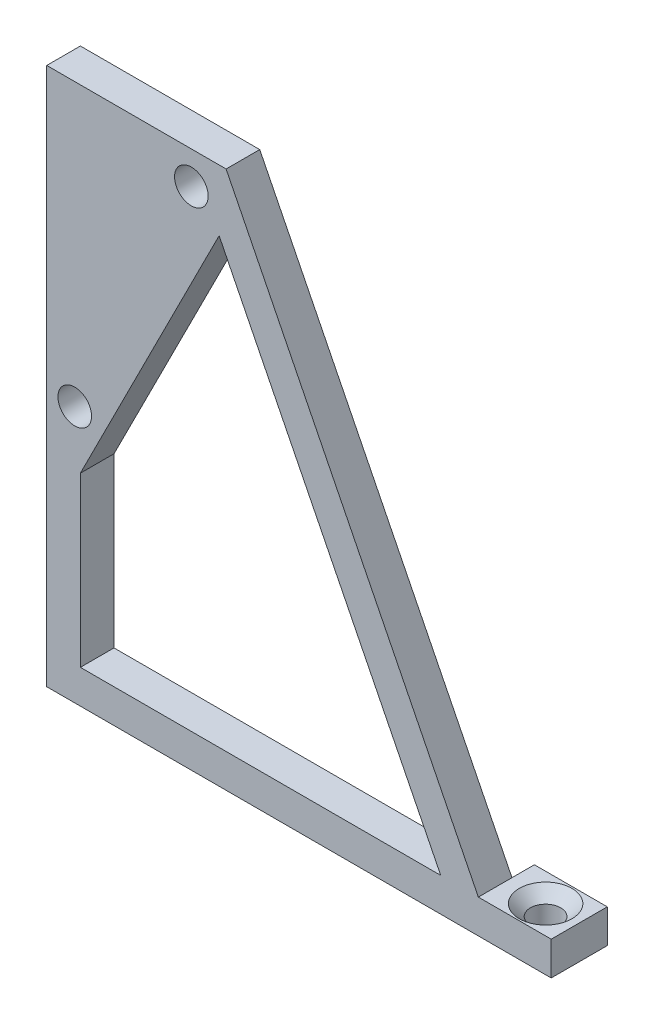
ISO-10303-21;
HEADER;
FILE_DESCRIPTION(('STEP AP214'),'2;1');
FILE_NAME('part.step','',(''),(''),'','','');
FILE_SCHEMA(('AUTOMOTIVE_DESIGN { 1 0 10303 214 1 1 1 1 }'));
ENDSEC;
DATA;
#1=APPLICATION_CONTEXT('core data for automotive mechanical design processes');
#2=APPLICATION_PROTOCOL_DEFINITION('international standard','automotive_design',2000,#1);
#3=PRODUCT_CONTEXT('',#1,'mechanical');
#4=PRODUCT('Part','Part','',(#3));
#5=PRODUCT_RELATED_PRODUCT_CATEGORY('part','',(#4));
#6=PRODUCT_DEFINITION_FORMATION('','',#4);
#7=PRODUCT_DEFINITION_CONTEXT('part definition',#1,'design');
#8=PRODUCT_DEFINITION('design','',#6,#7);
#9=PRODUCT_DEFINITION_SHAPE('','',#8);
#10=(LENGTH_UNIT() NAMED_UNIT(*) SI_UNIT(.MILLI.,.METRE.));
#11=(NAMED_UNIT(*) PLANE_ANGLE_UNIT() SI_UNIT($,.RADIAN.));
#12=(NAMED_UNIT(*) SI_UNIT($,.STERADIAN.) SOLID_ANGLE_UNIT());
#13=UNCERTAINTY_MEASURE_WITH_UNIT(LENGTH_MEASURE(1.E-05),#10,'distance_accuracy_value','');
#14=(GEOMETRIC_REPRESENTATION_CONTEXT(3) GLOBAL_UNCERTAINTY_ASSIGNED_CONTEXT((#13)) GLOBAL_UNIT_ASSIGNED_CONTEXT((#10,
#11,#12)) REPRESENTATION_CONTEXT('',''));
#15=CARTESIAN_POINT('',(0.,0.,0.));
#16=DIRECTION('',(0.,0.,1.));
#17=DIRECTION('',(1.,0.,0.));
#18=AXIS2_PLACEMENT_3D('',#15,#16,#17);
#19=CARTESIAN_POINT('',(0.,0.,0.));
#20=DIRECTION('',(0.,0.,1.));
#21=DIRECTION('',(1.,0.,0.));
#22=AXIS2_PLACEMENT_3D('',#19,#20,#21);
#23=PLANE('',#22);
#24=CARTESIAN_POINT('',(12.9,45.1,0.));
#25=DIRECTION('',(0.,0.,1.));
#26=DIRECTION('',(1.,0.,0.));
#27=AXIS2_PLACEMENT_3D('',#24,#25,#26);
#28=CIRCLE('',#27,1.5);
#29=CARTESIAN_POINT('',(14.4,45.1,0.));
#30=VERTEX_POINT('',#29);
#31=EDGE_CURVE('E158',#30,#30,#28,.T.);
#32=ORIENTED_EDGE('',*,*,#31,.T.);
#33=EDGE_LOOP('',(#32));
#34=FACE_BOUND('',#33,.T.);
#35=CARTESIAN_POINT('',(2.5,22.9,0.));
#36=DIRECTION('',(0.,0.,1.));
#37=DIRECTION('',(1.,0.,0.));
#38=AXIS2_PLACEMENT_3D('',#35,#36,#37);
#39=CIRCLE('',#38,1.5);
#40=CARTESIAN_POINT('',(4.00000000000001,22.9,0.));
#41=VERTEX_POINT('',#40);
#42=EDGE_CURVE('E162',#41,#41,#39,.T.);
#43=ORIENTED_EDGE('',*,*,#42,.T.);
#44=EDGE_LOOP('',(#43));
#45=FACE_BOUND('',#44,.T.);
#46=DIRECTION('',(0.,-1.,0.));
#47=VECTOR('',#46,1.);
#48=CARTESIAN_POINT('',(3.,18.,0.));
#49=LINE('',#48,#47);
#50=CARTESIAN_POINT('',(3.,18.,0.));
#51=VERTEX_POINT('',#50);
#52=CARTESIAN_POINT('',(3.00000000000001,3.,0.));
#53=VERTEX_POINT('',#52);
#54=EDGE_CURVE('E168',#51,#53,#49,.T.);
#55=ORIENTED_EDGE('',*,*,#54,.T.);
#56=DIRECTION('',(1.,0.,0.));
#57=VECTOR('',#56,1.);
#58=CARTESIAN_POINT('',(3.00000000000001,3.,0.));
#59=LINE('',#58,#57);
#60=CARTESIAN_POINT('',(35.1458980337503,2.99999999999999,0.));
#61=VERTEX_POINT('',#60);
#62=EDGE_CURVE('E183',#53,#61,#59,.T.);
#63=ORIENTED_EDGE('',*,*,#62,.T.);
#64=DIRECTION('',(-0.447213595499958,0.894427190999916,0.));
#65=VECTOR('',#64,1.);
#66=CARTESIAN_POINT('',(35.1458980337503,2.99999999999999,0.));
#67=LINE('',#66,#65);
#68=CARTESIAN_POINT('',(15.3782712398091,42.5352535878825,0.));
#69=VERTEX_POINT('',#68);
#70=EDGE_CURVE('E186',#61,#69,#67,.T.);
#71=ORIENTED_EDGE('',*,*,#70,.T.);
#72=DIRECTION('',(-0.450431679441175,-0.892810899438287,0.));
#73=VECTOR('',#72,1.);
#74=CARTESIAN_POINT('',(15.3782712398091,42.5352535878825,0.));
#75=LINE('',#74,#73);
#76=EDGE_CURVE('E174',#69,#51,#75,.T.);
#77=ORIENTED_EDGE('',*,*,#76,.T.);
#78=EDGE_LOOP('',(#55,#63,#71,#77));
#79=FACE_BOUND('',#78,.T.);
#80=DIRECTION('',(0.,1.,0.));
#81=VECTOR('',#80,1.);
#82=CARTESIAN_POINT('',(38.5,3.,0.));
#83=LINE('',#82,#81);
#84=CARTESIAN_POINT('',(38.5,0.,0.));
#85=VERTEX_POINT('',#84);
#86=CARTESIAN_POINT('',(38.5,3.,0.));
#87=VERTEX_POINT('',#86);
#88=EDGE_CURVE('E51',#85,#87,#83,.T.);
#89=ORIENTED_EDGE('',*,*,#88,.F.);
#90=DIRECTION('',(1.,0.,0.));
#91=VECTOR('',#90,1.);
#92=CARTESIAN_POINT('',(40.,0.,0.));
#93=LINE('',#92,#91);
#94=CARTESIAN_POINT('',(0.,0.,0.));
#95=VERTEX_POINT('',#94);
#96=EDGE_CURVE('E216',#95,#85,#93,.T.);
#97=ORIENTED_EDGE('',*,*,#96,.F.);
#98=DIRECTION('',(0.,-1.,0.));
#99=VECTOR('',#98,1.);
#100=CARTESIAN_POINT('',(0.,48.,0.));
#101=LINE('',#100,#99);
#102=CARTESIAN_POINT('',(0.,48.,0.));
#103=VERTEX_POINT('',#102);
#104=EDGE_CURVE('E199',#103,#95,#101,.T.);
#105=ORIENTED_EDGE('',*,*,#104,.F.);
#106=DIRECTION('',(-1.,0.,0.));
#107=VECTOR('',#106,1.);
#108=CARTESIAN_POINT('',(16.,48.,0.));
#109=LINE('',#108,#107);
#110=CARTESIAN_POINT('',(16.,48.,0.));
#111=VERTEX_POINT('',#110);
#112=EDGE_CURVE('E204',#111,#103,#109,.T.);
#113=ORIENTED_EDGE('',*,*,#112,.F.);
#114=DIRECTION('',(-0.447213595499958,0.894427190999916,0.));
#115=VECTOR('',#114,1.);
#116=CARTESIAN_POINT('',(38.5,3.,0.));
#117=LINE('',#116,#115);
#118=EDGE_CURVE('E218',#87,#111,#117,.T.);
#119=ORIENTED_EDGE('',*,*,#118,.F.);
#120=EDGE_LOOP('',(#89,#97,#105,#113,#119));
#121=FACE_BOUND('',#120,.T.);
#122=ADVANCED_FACE('F35',(#34,#45,#79,#121),#23,.F.);
#123=CARTESIAN_POINT('',(0.,0.,3.));
#124=DIRECTION('',(0.,0.,1.));
#125=DIRECTION('',(1.,0.,0.));
#126=AXIS2_PLACEMENT_3D('',#123,#124,#125);
#127=PLANE('',#126);
#128=CARTESIAN_POINT('',(2.5,22.9,3.));
#129=DIRECTION('',(0.,0.,1.));
#130=DIRECTION('',(1.,0.,0.));
#131=AXIS2_PLACEMENT_3D('',#128,#129,#130);
#132=CIRCLE('',#131,1.5);
#133=CARTESIAN_POINT('',(4.00000000000001,22.9,3.));
#134=VERTEX_POINT('',#133);
#135=EDGE_CURVE('E165',#134,#134,#132,.T.);
#136=ORIENTED_EDGE('',*,*,#135,.F.);
#137=EDGE_LOOP('',(#136));
#138=FACE_BOUND('',#137,.T.);
#139=DIRECTION('',(0.,-1.,0.));
#140=VECTOR('',#139,1.);
#141=CARTESIAN_POINT('',(0.,48.,3.));
#142=LINE('',#141,#140);
#143=CARTESIAN_POINT('',(0.,48.,3.));
#144=VERTEX_POINT('',#143);
#145=CARTESIAN_POINT('',(0.,0.,3.));
#146=VERTEX_POINT('',#145);
#147=EDGE_CURVE('E200',#144,#146,#142,.T.);
#148=ORIENTED_EDGE('',*,*,#147,.T.);
#149=DIRECTION('',(1.,0.,0.));
#150=VECTOR('',#149,1.);
#151=CARTESIAN_POINT('',(0.,0.,3.));
#152=LINE('',#151,#150);
#153=CARTESIAN_POINT('',(45.,0.,3.));
#154=VERTEX_POINT('',#153);
#155=EDGE_CURVE('E203',#146,#154,#152,.T.);
#156=ORIENTED_EDGE('',*,*,#155,.T.);
#157=DIRECTION('',(0.,1.,0.));
#158=VECTOR('',#157,1.);
#159=CARTESIAN_POINT('',(45.,0.,3.));
#160=LINE('',#159,#158);
#161=CARTESIAN_POINT('',(45.,3.,3.));
#162=VERTEX_POINT('',#161);
#163=EDGE_CURVE('E129',#154,#162,#160,.T.);
#164=ORIENTED_EDGE('',*,*,#163,.T.);
#165=DIRECTION('',(-1.,0.,0.));
#166=VECTOR('',#165,1.);
#167=CARTESIAN_POINT('',(45.,3.,3.));
#168=LINE('',#167,#166);
#169=CARTESIAN_POINT('',(38.5,3.,3.));
#170=VERTEX_POINT('',#169);
#171=EDGE_CURVE('E207',#162,#170,#168,.T.);
#172=ORIENTED_EDGE('',*,*,#171,.T.);
#173=DIRECTION('',(-0.447213595499958,0.894427190999916,0.));
#174=VECTOR('',#173,1.);
#175=CARTESIAN_POINT('',(38.5,3.,3.));
#176=LINE('',#175,#174);
#177=CARTESIAN_POINT('',(16.,48.,3.));
#178=VERTEX_POINT('',#177);
#179=EDGE_CURVE('E209',#170,#178,#176,.T.);
#180=ORIENTED_EDGE('',*,*,#179,.T.);
#181=DIRECTION('',(-1.,0.,0.));
#182=VECTOR('',#181,1.);
#183=CARTESIAN_POINT('',(16.,48.,3.));
#184=LINE('',#183,#182);
#185=EDGE_CURVE('E211',#178,#144,#184,.T.);
#186=ORIENTED_EDGE('',*,*,#185,.T.);
#187=EDGE_LOOP('',(#148,#156,#164,#172,#180,#186));
#188=FACE_BOUND('',#187,.T.);
#189=DIRECTION('',(1.,0.,0.));
#190=VECTOR('',#189,1.);
#191=CARTESIAN_POINT('',(3.00000000000001,3.,3.));
#192=LINE('',#191,#190);
#193=CARTESIAN_POINT('',(3.00000000000001,3.,3.));
#194=VERTEX_POINT('',#193);
#195=CARTESIAN_POINT('',(35.1458980337503,2.99999999999999,3.));
#196=VERTEX_POINT('',#195);
#197=EDGE_CURVE('E173',#194,#196,#192,.T.);
#198=ORIENTED_EDGE('',*,*,#197,.F.);
#199=DIRECTION('',(0.,-1.,0.));
#200=VECTOR('',#199,1.);
#201=CARTESIAN_POINT('',(3.,18.,3.));
#202=LINE('',#201,#200);
#203=CARTESIAN_POINT('',(3.,18.,3.));
#204=VERTEX_POINT('',#203);
#205=EDGE_CURVE('E171',#204,#194,#202,.T.);
#206=ORIENTED_EDGE('',*,*,#205,.F.);
#207=DIRECTION('',(-0.450431679441175,-0.892810899438287,0.));
#208=VECTOR('',#207,1.);
#209=CARTESIAN_POINT('',(15.3782712398091,42.5352535878825,3.));
#210=LINE('',#209,#208);
#211=CARTESIAN_POINT('',(15.3782712398091,42.5352535878825,3.));
#212=VERTEX_POINT('',#211);
#213=EDGE_CURVE('E178',#212,#204,#210,.T.);
#214=ORIENTED_EDGE('',*,*,#213,.F.);
#215=DIRECTION('',(-0.447213595499958,0.894427190999916,0.));
#216=VECTOR('',#215,1.);
#217=CARTESIAN_POINT('',(35.1458980337503,2.99999999999999,3.));
#218=LINE('',#217,#216);
#219=EDGE_CURVE('E176',#196,#212,#218,.T.);
#220=ORIENTED_EDGE('',*,*,#219,.F.);
#221=EDGE_LOOP('',(#198,#206,#214,#220));
#222=FACE_BOUND('',#221,.T.);
#223=CARTESIAN_POINT('',(12.9,45.1,3.));
#224=DIRECTION('',(0.,0.,1.));
#225=DIRECTION('',(1.,0.,0.));
#226=AXIS2_PLACEMENT_3D('',#223,#224,#225);
#227=CIRCLE('',#226,1.5);
#228=CARTESIAN_POINT('',(14.4,45.1,3.));
#229=VERTEX_POINT('',#228);
#230=EDGE_CURVE('E159',#229,#229,#227,.T.);
#231=ORIENTED_EDGE('',*,*,#230,.F.);
#232=EDGE_LOOP('',(#231));
#233=FACE_BOUND('',#232,.T.);
#234=ADVANCED_FACE('F245',(#138,#188,#222,#233),#127,.T.);
#235=CARTESIAN_POINT('',(0.,48.,3.));
#236=DIRECTION('',(1.,0.,0.));
#237=DIRECTION('',(0.,1.,0.));
#238=AXIS2_PLACEMENT_3D('',#235,#236,#237);
#239=PLANE('',#238);
#240=ORIENTED_EDGE('',*,*,#104,.T.);
#241=DIRECTION('',(0.,0.,-1.));
#242=VECTOR('',#241,1.);
#243=CARTESIAN_POINT('',(0.,0.,3.));
#244=LINE('',#243,#242);
#245=EDGE_CURVE('E131',#146,#95,#244,.T.);
#246=ORIENTED_EDGE('',*,*,#245,.F.);
#247=ORIENTED_EDGE('',*,*,#147,.F.);
#248=DIRECTION('',(0.,0.,-1.));
#249=VECTOR('',#248,1.);
#250=CARTESIAN_POINT('',(0.,48.,3.));
#251=LINE('',#250,#249);
#252=EDGE_CURVE('E213',#144,#103,#251,.T.);
#253=ORIENTED_EDGE('',*,*,#252,.T.);
#254=EDGE_LOOP('',(#240,#246,#247,#253));
#255=FACE_BOUND('',#254,.T.);
#256=ADVANCED_FACE('F251',(#255),#239,.F.);
#257=CARTESIAN_POINT('',(40.,0.,3.));
#258=DIRECTION('',(0.,1.,0.));
#259=DIRECTION('',(0.,0.,1.));
#260=AXIS2_PLACEMENT_3D('',#257,#258,#259);
#261=PLANE('',#260);
#262=CARTESIAN_POINT('',(42.,0.,0.5));
#263=DIRECTION('',(0.,1.,0.));
#264=DIRECTION('',(-1.,0.,0.));
#265=AXIS2_PLACEMENT_3D('',#262,#263,#264);
#266=CIRCLE('',#265,1.35);
#267=CARTESIAN_POINT('',(40.65,0.,0.5));
#268=VERTEX_POINT('',#267);
#269=EDGE_CURVE('E148',#268,#268,#266,.T.);
#270=ORIENTED_EDGE('',*,*,#269,.T.);
#271=EDGE_LOOP('',(#270));
#272=FACE_BOUND('',#271,.T.);
#273=ORIENTED_EDGE('',*,*,#96,.T.);
#274=DIRECTION('',(0.,0.,1.));
#275=VECTOR('',#274,1.);
#276=CARTESIAN_POINT('',(38.5,0.,-2.));
#277=LINE('',#276,#275);
#278=CARTESIAN_POINT('',(38.5,0.,-2.));
#279=VERTEX_POINT('',#278);
#280=EDGE_CURVE('E138',#279,#85,#277,.T.);
#281=ORIENTED_EDGE('',*,*,#280,.F.);
#282=DIRECTION('',(-1.,0.,0.));
#283=VECTOR('',#282,1.);
#284=CARTESIAN_POINT('',(45.,0.,-2.));
#285=LINE('',#284,#283);
#286=CARTESIAN_POINT('',(45.,0.,-2.));
#287=VERTEX_POINT('',#286);
#288=EDGE_CURVE('E135',#287,#279,#285,.T.);
#289=ORIENTED_EDGE('',*,*,#288,.F.);
#290=DIRECTION('',(0.,0.,-1.));
#291=VECTOR('',#290,1.);
#292=CARTESIAN_POINT('',(45.,0.,3.));
#293=LINE('',#292,#291);
#294=EDGE_CURVE('E123',#154,#287,#293,.T.);
#295=ORIENTED_EDGE('',*,*,#294,.F.);
#296=ORIENTED_EDGE('',*,*,#155,.F.);
#297=ORIENTED_EDGE('',*,*,#245,.T.);
#298=EDGE_LOOP('',(#273,#281,#289,#295,#296,#297));
#299=FACE_BOUND('',#298,.T.);
#300=ADVANCED_FACE('F136',(#272,#299),#261,.F.);
#301=CARTESIAN_POINT('',(45.,0.,3.));
#302=DIRECTION('',(-1.,0.,0.));
#303=DIRECTION('',(0.,0.,1.));
#304=AXIS2_PLACEMENT_3D('',#301,#302,#303);
#305=PLANE('',#304);
#306=ORIENTED_EDGE('',*,*,#294,.T.);
#307=DIRECTION('',(0.,-1.,0.));
#308=VECTOR('',#307,1.);
#309=CARTESIAN_POINT('',(45.,3.,-2.));
#310=LINE('',#309,#308);
#311=CARTESIAN_POINT('',(45.,3.,-2.));
#312=VERTEX_POINT('',#311);
#313=EDGE_CURVE('E128',#312,#287,#310,.T.);
#314=ORIENTED_EDGE('',*,*,#313,.F.);
#315=DIRECTION('',(0.,0.,-1.));
#316=VECTOR('',#315,1.);
#317=CARTESIAN_POINT('',(45.,3.,3.));
#318=LINE('',#317,#316);
#319=EDGE_CURVE('E132',#162,#312,#318,.T.);
#320=ORIENTED_EDGE('',*,*,#319,.F.);
#321=ORIENTED_EDGE('',*,*,#163,.F.);
#322=EDGE_LOOP('',(#306,#314,#320,#321));
#323=FACE_BOUND('',#322,.T.);
#324=ADVANCED_FACE('F125',(#323),#305,.F.);
#325=CARTESIAN_POINT('',(45.,3.,3.));
#326=DIRECTION('',(0.,-1.,0.));
#327=DIRECTION('',(1.,0.,0.));
#328=AXIS2_PLACEMENT_3D('',#325,#326,#327);
#329=PLANE('',#328);
#330=CARTESIAN_POINT('',(42.,3.,0.5));
#331=DIRECTION('',(0.,-1.,0.));
#332=DIRECTION('',(1.,0.,0.));
#333=AXIS2_PLACEMENT_3D('',#330,#331,#332);
#334=CIRCLE('',#333,2.34999999999999);
#335=CARTESIAN_POINT('',(44.35,3.,0.5));
#336=VERTEX_POINT('',#335);
#337=EDGE_CURVE('E11',#336,#336,#334,.T.);
#338=ORIENTED_EDGE('',*,*,#337,.T.);
#339=EDGE_LOOP('',(#338));
#340=FACE_BOUND('',#339,.T.);
#341=ORIENTED_EDGE('',*,*,#319,.T.);
#342=DIRECTION('',(1.,0.,0.));
#343=VECTOR('',#342,1.);
#344=CARTESIAN_POINT('',(45.,3.,-2.));
#345=LINE('',#344,#343);
#346=CARTESIAN_POINT('',(38.5,3.,-2.));
#347=VERTEX_POINT('',#346);
#348=EDGE_CURVE('E146',#347,#312,#345,.T.);
#349=ORIENTED_EDGE('',*,*,#348,.F.);
#350=DIRECTION('',(0.,0.,1.));
#351=VECTOR('',#350,1.);
#352=CARTESIAN_POINT('',(38.5,3.,-2.));
#353=LINE('',#352,#351);
#354=EDGE_CURVE('E153',#347,#87,#353,.T.);
#355=ORIENTED_EDGE('',*,*,#354,.T.);
#356=DIRECTION('',(0.,0.,-1.));
#357=VECTOR('',#356,1.);
#358=CARTESIAN_POINT('',(38.5,3.,3.));
#359=LINE('',#358,#357);
#360=EDGE_CURVE('E226',#170,#87,#359,.T.);
#361=ORIENTED_EDGE('',*,*,#360,.F.);
#362=ORIENTED_EDGE('',*,*,#171,.F.);
#363=EDGE_LOOP('',(#341,#349,#355,#361,#362));
#364=FACE_BOUND('',#363,.T.);
#365=ADVANCED_FACE('F265',(#340,#364),#329,.F.);
#366=CARTESIAN_POINT('',(38.5,3.,3.));
#367=DIRECTION('',(-0.894427190999916,-0.447213595499958,0.));
#368=DIRECTION('',(0.447213595499958,-0.894427190999916,0.));
#369=AXIS2_PLACEMENT_3D('',#366,#367,#368);
#370=PLANE('',#369);
#371=ORIENTED_EDGE('',*,*,#118,.T.);
#372=DIRECTION('',(0.,0.,-1.));
#373=VECTOR('',#372,1.);
#374=CARTESIAN_POINT('',(16.,48.,3.));
#375=LINE('',#374,#373);
#376=EDGE_CURVE('E223',#178,#111,#375,.T.);
#377=ORIENTED_EDGE('',*,*,#376,.F.);
#378=ORIENTED_EDGE('',*,*,#179,.F.);
#379=ORIENTED_EDGE('',*,*,#360,.T.);
#380=EDGE_LOOP('',(#371,#377,#378,#379));
#381=FACE_BOUND('',#380,.T.);
#382=ADVANCED_FACE('F261',(#381),#370,.F.);
#383=CARTESIAN_POINT('',(16.,48.,3.));
#384=DIRECTION('',(0.,-1.,0.));
#385=DIRECTION('',(0.,0.,-1.));
#386=AXIS2_PLACEMENT_3D('',#383,#384,#385);
#387=PLANE('',#386);
#388=ORIENTED_EDGE('',*,*,#112,.T.);
#389=ORIENTED_EDGE('',*,*,#252,.F.);
#390=ORIENTED_EDGE('',*,*,#185,.F.);
#391=ORIENTED_EDGE('',*,*,#376,.T.);
#392=EDGE_LOOP('',(#388,#389,#390,#391));
#393=FACE_BOUND('',#392,.T.);
#394=ADVANCED_FACE('F257',(#393),#387,.F.);
#395=CARTESIAN_POINT('',(3.,18.,3.));
#396=DIRECTION('',(1.,0.,0.));
#397=DIRECTION('',(0.,1.,0.));
#398=AXIS2_PLACEMENT_3D('',#395,#396,#397);
#399=PLANE('',#398);
#400=ORIENTED_EDGE('',*,*,#54,.F.);
#401=DIRECTION('',(0.,0.,-1.));
#402=VECTOR('',#401,1.);
#403=CARTESIAN_POINT('',(3.,18.,3.));
#404=LINE('',#403,#402);
#405=EDGE_CURVE('E180',#204,#51,#404,.T.);
#406=ORIENTED_EDGE('',*,*,#405,.F.);
#407=ORIENTED_EDGE('',*,*,#205,.T.);
#408=DIRECTION('',(0.,0.,-1.));
#409=VECTOR('',#408,1.);
#410=CARTESIAN_POINT('',(3.00000000000001,3.,3.));
#411=LINE('',#410,#409);
#412=EDGE_CURVE('E196',#194,#53,#411,.T.);
#413=ORIENTED_EDGE('',*,*,#412,.T.);
#414=EDGE_LOOP('',(#400,#406,#407,#413));
#415=FACE_BOUND('',#414,.T.);
#416=ADVANCED_FACE('F260',(#415),#399,.T.);
#417=CARTESIAN_POINT('',(3.00000000000001,3.,3.));
#418=DIRECTION('',(0.,1.,0.));
#419=DIRECTION('',(-1.,0.,0.));
#420=AXIS2_PLACEMENT_3D('',#417,#418,#419);
#421=PLANE('',#420);
#422=ORIENTED_EDGE('',*,*,#62,.F.);
#423=ORIENTED_EDGE('',*,*,#412,.F.);
#424=ORIENTED_EDGE('',*,*,#197,.T.);
#425=DIRECTION('',(0.,0.,-1.));
#426=VECTOR('',#425,1.);
#427=CARTESIAN_POINT('',(35.1458980337503,2.99999999999999,3.));
#428=LINE('',#427,#426);
#429=EDGE_CURVE('E194',#196,#61,#428,.T.);
#430=ORIENTED_EDGE('',*,*,#429,.T.);
#431=EDGE_LOOP('',(#422,#423,#424,#430));
#432=FACE_BOUND('',#431,.T.);
#433=ADVANCED_FACE('F315',(#432),#421,.T.);
#434=CARTESIAN_POINT('',(35.1458980337503,2.99999999999999,3.));
#435=DIRECTION('',(-0.894427190999916,-0.447213595499958,0.));
#436=DIRECTION('',(0.447213595499958,-0.894427190999916,0.));
#437=AXIS2_PLACEMENT_3D('',#434,#435,#436);
#438=PLANE('',#437);
#439=ORIENTED_EDGE('',*,*,#70,.F.);
#440=ORIENTED_EDGE('',*,*,#429,.F.);
#441=ORIENTED_EDGE('',*,*,#219,.T.);
#442=DIRECTION('',(0.,0.,-1.));
#443=VECTOR('',#442,1.);
#444=CARTESIAN_POINT('',(15.3782712398091,42.5352535878825,3.));
#445=LINE('',#444,#443);
#446=EDGE_CURVE('E59',#212,#69,#445,.T.);
#447=ORIENTED_EDGE('',*,*,#446,.T.);
#448=EDGE_LOOP('',(#439,#440,#441,#447));
#449=FACE_BOUND('',#448,.T.);
#450=ADVANCED_FACE('F312',(#449),#438,.T.);
#451=CARTESIAN_POINT('',(15.3782712398091,42.5352535878825,3.));
#452=DIRECTION('',(0.892810899438287,-0.450431679441175,0.));
#453=DIRECTION('',(0.450431679441175,0.892810899438287,0.));
#454=AXIS2_PLACEMENT_3D('',#451,#452,#453);
#455=PLANE('',#454);
#456=ORIENTED_EDGE('',*,*,#76,.F.);
#457=ORIENTED_EDGE('',*,*,#446,.F.);
#458=ORIENTED_EDGE('',*,*,#213,.T.);
#459=ORIENTED_EDGE('',*,*,#405,.T.);
#460=EDGE_LOOP('',(#456,#457,#458,#459));
#461=FACE_BOUND('',#460,.T.);
#462=ADVANCED_FACE('F308',(#461),#455,.T.);
#463=CARTESIAN_POINT('',(2.5,22.9,3.));
#464=DIRECTION('',(0.,0.,-1.));
#465=DIRECTION('',(-1.,0.,0.));
#466=AXIS2_PLACEMENT_3D('',#463,#464,#465);
#467=CYLINDRICAL_SURFACE('',#466,1.5);
#468=ORIENTED_EDGE('',*,*,#135,.T.);
#469=EDGE_LOOP('',(#468));
#470=FACE_BOUND('',#469,.T.);
#471=ORIENTED_EDGE('',*,*,#42,.F.);
#472=EDGE_LOOP('',(#471));
#473=FACE_BOUND('',#472,.T.);
#474=ADVANCED_FACE('F302',(#470,#473),#467,.F.);
#475=CARTESIAN_POINT('',(12.9,45.1,3.));
#476=DIRECTION('',(0.,0.,-1.));
#477=DIRECTION('',(-1.,0.,0.));
#478=AXIS2_PLACEMENT_3D('',#475,#476,#477);
#479=CYLINDRICAL_SURFACE('',#478,1.5);
#480=ORIENTED_EDGE('',*,*,#230,.T.);
#481=EDGE_LOOP('',(#480));
#482=FACE_BOUND('',#481,.T.);
#483=ORIENTED_EDGE('',*,*,#31,.F.);
#484=EDGE_LOOP('',(#483));
#485=FACE_BOUND('',#484,.T.);
#486=ADVANCED_FACE('F295',(#482,#485),#479,.F.);
#487=CARTESIAN_POINT('',(38.5,3.,-2.));
#488=DIRECTION('',(1.,0.,0.));
#489=DIRECTION('',(0.,0.,-1.));
#490=AXIS2_PLACEMENT_3D('',#487,#488,#489);
#491=PLANE('',#490);
#492=ORIENTED_EDGE('',*,*,#88,.T.);
#493=ORIENTED_EDGE('',*,*,#354,.F.);
#494=DIRECTION('',(0.,1.,0.));
#495=VECTOR('',#494,1.);
#496=CARTESIAN_POINT('',(38.5,3.,-2.));
#497=LINE('',#496,#495);
#498=EDGE_CURVE('E141',#279,#347,#497,.T.);
#499=ORIENTED_EDGE('',*,*,#498,.F.);
#500=ORIENTED_EDGE('',*,*,#280,.T.);
#501=EDGE_LOOP('',(#492,#493,#499,#500));
#502=FACE_BOUND('',#501,.T.);
#503=ADVANCED_FACE('F293',(#502),#491,.F.);
#504=CARTESIAN_POINT('',(0.,0.,-2.));
#505=DIRECTION('',(0.,0.,-1.));
#506=DIRECTION('',(-1.,0.,0.));
#507=AXIS2_PLACEMENT_3D('',#504,#505,#506);
#508=PLANE('',#507);
#509=ORIENTED_EDGE('',*,*,#313,.T.);
#510=ORIENTED_EDGE('',*,*,#288,.T.);
#511=ORIENTED_EDGE('',*,*,#498,.T.);
#512=ORIENTED_EDGE('',*,*,#348,.T.);
#513=EDGE_LOOP('',(#509,#510,#511,#512));
#514=FACE_BOUND('',#513,.T.);
#515=ADVANCED_FACE('F144',(#514),#508,.T.);
#516=CARTESIAN_POINT('',(42.,0.,0.5));
#517=DIRECTION('',(0.,1.,0.));
#518=DIRECTION('',(-1.,0.,0.));
#519=AXIS2_PLACEMENT_3D('',#516,#517,#518);
#520=CYLINDRICAL_SURFACE('',#519,1.35);
#521=CARTESIAN_POINT('',(42.,2.00000000000001,0.5));
#522=DIRECTION('',(0.,-1.,0.));
#523=DIRECTION('',(0.,0.,-1.));
#524=AXIS2_PLACEMENT_3D('',#521,#522,#523);
#525=CIRCLE('',#524,1.35);
#526=CARTESIAN_POINT('',(42.,2.00000000000001,-0.849999999999999));
#527=VERTEX_POINT('',#526);
#528=EDGE_CURVE('E44',#527,#527,#525,.F.);
#529=ORIENTED_EDGE('',*,*,#528,.T.);
#530=EDGE_LOOP('',(#529));
#531=FACE_BOUND('',#530,.T.);
#532=ORIENTED_EDGE('',*,*,#269,.F.);
#533=EDGE_LOOP('',(#532));
#534=FACE_BOUND('',#533,.T.);
#535=ADVANCED_FACE('F234',(#531,#534),#520,.F.);
#536=CARTESIAN_POINT('',(42.,2.00000000000001,0.5));
#537=DIRECTION('',(0.,1.,0.));
#538=DIRECTION('',(0.,0.,1.));
#539=AXIS2_PLACEMENT_3D('',#536,#537,#538);
#540=CONICAL_SURFACE('',#539,1.35,0.78539816339745);
#541=ORIENTED_EDGE('',*,*,#337,.F.);
#542=EDGE_LOOP('',(#541));
#543=FACE_BOUND('',#542,.T.);
#544=ORIENTED_EDGE('',*,*,#528,.F.);
#545=EDGE_LOOP('',(#544));
#546=FACE_BOUND('',#545,.T.);
#547=ADVANCED_FACE('F38',(#543,#546),#540,.F.);
#548=CLOSED_SHELL('',(#122,#234,#256,#300,#324,#365,#382,#394,#416,#433,#450,#462,#474,#486,
#503,#515,#535,#547));
#549=MANIFOLD_SOLID_BREP('B2',#548);
#550=ADVANCED_BREP_SHAPE_REPRESENTATION('',(#18,#549),#14);
#551=SHAPE_DEFINITION_REPRESENTATION(#9,#550);
ENDSEC;
END-ISO-10303-21;
